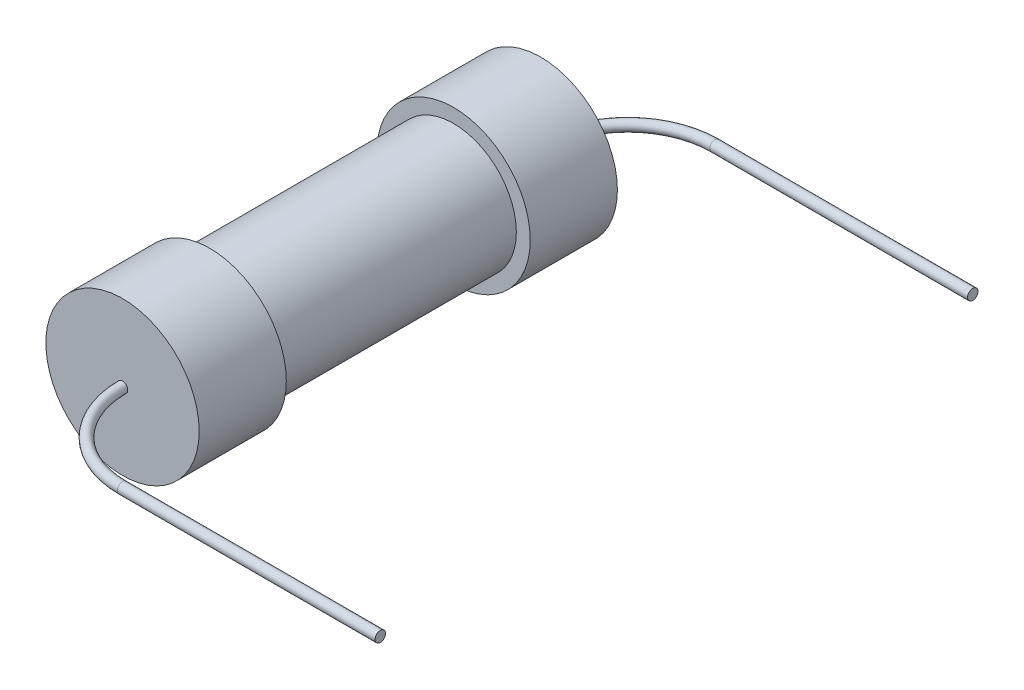
ISO-10303-21;
HEADER;
FILE_DESCRIPTION(('STEP AP214'),'2;1');
FILE_NAME('part.step','',(''),(''),'','','');
FILE_SCHEMA(('AUTOMOTIVE_DESIGN { 1 0 10303 214 1 1 1 1 }'));
ENDSEC;
DATA;
#1=APPLICATION_CONTEXT('core data for automotive mechanical design processes');
#2=APPLICATION_PROTOCOL_DEFINITION('international standard','automotive_design',2000,#1);
#3=PRODUCT_CONTEXT('',#1,'mechanical');
#4=PRODUCT('Part','Part','',(#3));
#5=PRODUCT_RELATED_PRODUCT_CATEGORY('part','',(#4));
#6=PRODUCT_DEFINITION_FORMATION('','',#4);
#7=PRODUCT_DEFINITION_CONTEXT('part definition',#1,'design');
#8=PRODUCT_DEFINITION('design','',#6,#7);
#9=PRODUCT_DEFINITION_SHAPE('','',#8);
#10=(LENGTH_UNIT() NAMED_UNIT(*) SI_UNIT(.MILLI.,.METRE.));
#11=(NAMED_UNIT(*) PLANE_ANGLE_UNIT() SI_UNIT($,.RADIAN.));
#12=(NAMED_UNIT(*) SI_UNIT($,.STERADIAN.) SOLID_ANGLE_UNIT());
#13=UNCERTAINTY_MEASURE_WITH_UNIT(LENGTH_MEASURE(1.E-05),#10,'distance_accuracy_value','');
#14=(GEOMETRIC_REPRESENTATION_CONTEXT(3) GLOBAL_UNCERTAINTY_ASSIGNED_CONTEXT((#13)) GLOBAL_UNIT_ASSIGNED_CONTEXT((#10,
#11,#12)) REPRESENTATION_CONTEXT('',''));
#15=CARTESIAN_POINT('',(0.,0.,0.));
#16=DIRECTION('',(0.,0.,1.));
#17=DIRECTION('',(1.,0.,0.));
#18=AXIS2_PLACEMENT_3D('',#15,#16,#17);
#19=CARTESIAN_POINT('',(0.,0.,3.));
#20=DIRECTION('',(0.,0.,1.));
#21=DIRECTION('',(1.,0.,0.));
#22=AXIS2_PLACEMENT_3D('',#19,#20,#21);
#23=CYLINDRICAL_SURFACE('',#22,0.9);
#24=CARTESIAN_POINT('',(0.,0.,-1.75));
#25=DIRECTION('',(0.,0.,1.));
#26=DIRECTION('',(1.,0.,0.));
#27=AXIS2_PLACEMENT_3D('',#24,#25,#26);
#28=CIRCLE('',#27,0.9);
#29=CARTESIAN_POINT('',(0.9,0.,-1.75));
#30=VERTEX_POINT('',#29);
#31=EDGE_CURVE('E67',#30,#30,#28,.T.);
#32=ORIENTED_EDGE('',*,*,#31,.T.);
#33=EDGE_LOOP('',(#32));
#34=FACE_BOUND('',#33,.T.);
#35=CARTESIAN_POINT('',(0.,0.,1.75));
#36=DIRECTION('',(0.,0.,1.));
#37=DIRECTION('',(1.,0.,0.));
#38=AXIS2_PLACEMENT_3D('',#35,#36,#37);
#39=CIRCLE('',#38,0.9);
#40=CARTESIAN_POINT('',(0.9,0.,1.75));
#41=VERTEX_POINT('',#40);
#42=EDGE_CURVE('E85',#41,#41,#39,.T.);
#43=ORIENTED_EDGE('',*,*,#42,.F.);
#44=EDGE_LOOP('',(#43));
#45=FACE_BOUND('',#44,.T.);
#46=ADVANCED_FACE('F57',(#34,#45),#23,.T.);
#47=CARTESIAN_POINT('',(1.1,0.,-1.75));
#48=DIRECTION('',(0.,0.,1.));
#49=DIRECTION('',(1.,0.,0.));
#50=AXIS2_PLACEMENT_3D('',#47,#48,#49);
#51=PLANE('',#50);
#52=CARTESIAN_POINT('',(0.,0.,-1.75));
#53=DIRECTION('',(0.,0.,1.));
#54=DIRECTION('',(1.,0.,0.));
#55=AXIS2_PLACEMENT_3D('',#52,#53,#54);
#56=CIRCLE('',#55,1.1);
#57=CARTESIAN_POINT('',(1.1,0.,-1.75));
#58=VERTEX_POINT('',#57);
#59=EDGE_CURVE('E71',#58,#58,#56,.T.);
#60=ORIENTED_EDGE('',*,*,#59,.T.);
#61=EDGE_LOOP('',(#60));
#62=FACE_BOUND('',#61,.T.);
#63=ORIENTED_EDGE('',*,*,#31,.F.);
#64=EDGE_LOOP('',(#63));
#65=FACE_BOUND('',#64,.T.);
#66=ADVANCED_FACE('F118',(#62,#65),#51,.T.);
#67=CARTESIAN_POINT('',(0.,0.,3.));
#68=DIRECTION('',(0.,0.,1.));
#69=DIRECTION('',(1.,0.,0.));
#70=AXIS2_PLACEMENT_3D('',#67,#68,#69);
#71=CYLINDRICAL_SURFACE('',#70,1.1);
#72=CARTESIAN_POINT('',(0.,0.,-3.));
#73=DIRECTION('',(0.,0.,1.));
#74=DIRECTION('',(1.,0.,0.));
#75=AXIS2_PLACEMENT_3D('',#72,#73,#74);
#76=CIRCLE('',#75,1.1);
#77=CARTESIAN_POINT('',(1.1,0.,-3.));
#78=VERTEX_POINT('',#77);
#79=EDGE_CURVE('E76',#78,#78,#76,.T.);
#80=ORIENTED_EDGE('',*,*,#79,.T.);
#81=EDGE_LOOP('',(#80));
#82=FACE_BOUND('',#81,.T.);
#83=ORIENTED_EDGE('',*,*,#59,.F.);
#84=EDGE_LOOP('',(#83));
#85=FACE_BOUND('',#84,.T.);
#86=ADVANCED_FACE('F123',(#82,#85),#71,.T.);
#87=CARTESIAN_POINT('',(0.,0.,-3.));
#88=DIRECTION('',(0.,0.,-1.));
#89=DIRECTION('',(-1.,0.,0.));
#90=AXIS2_PLACEMENT_3D('',#87,#88,#89);
#91=PLANE('',#90);
#92=CARTESIAN_POINT('',(0.,0.,-2.99999999999999));
#93=DIRECTION('',(0.,0.,-1.));
#94=DIRECTION('',(-1.,0.,0.));
#95=AXIS2_PLACEMENT_3D('',#92,#93,#94);
#96=CIRCLE('',#95,0.075);
#97=CARTESIAN_POINT('',(-0.0750000000000002,0.,-2.99999999999999));
#98=VERTEX_POINT('',#97);
#99=EDGE_CURVE('E63',#98,#98,#96,.T.);
#100=ORIENTED_EDGE('',*,*,#99,.F.);
#101=EDGE_LOOP('',(#100));
#102=FACE_BOUND('',#101,.T.);
#103=ORIENTED_EDGE('',*,*,#79,.F.);
#104=EDGE_LOOP('',(#103));
#105=FACE_BOUND('',#104,.T.);
#106=ADVANCED_FACE('F143',(#102,#105),#91,.T.);
#107=CARTESIAN_POINT('',(1.1,0.,3.));
#108=DIRECTION('',(0.,0.,1.));
#109=DIRECTION('',(1.,0.,0.));
#110=AXIS2_PLACEMENT_3D('',#107,#108,#109);
#111=PLANE('',#110);
#112=CARTESIAN_POINT('',(0.,0.,2.99999999999999));
#113=DIRECTION('',(0.,0.,1.));
#114=DIRECTION('',(1.,0.,0.));
#115=AXIS2_PLACEMENT_3D('',#112,#113,#114);
#116=CIRCLE('',#115,0.075);
#117=CARTESIAN_POINT('',(-0.0750000000000002,0.,2.99999999999999));
#118=VERTEX_POINT('',#117);
#119=EDGE_CURVE('E11',#118,#118,#116,.T.);
#120=ORIENTED_EDGE('',*,*,#119,.F.);
#121=EDGE_LOOP('',(#120));
#122=FACE_BOUND('',#121,.T.);
#123=CARTESIAN_POINT('',(0.,0.,3.));
#124=DIRECTION('',(0.,0.,1.));
#125=DIRECTION('',(1.,0.,0.));
#126=AXIS2_PLACEMENT_3D('',#123,#124,#125);
#127=CIRCLE('',#126,1.1);
#128=CARTESIAN_POINT('',(1.1,0.,3.));
#129=VERTEX_POINT('',#128);
#130=EDGE_CURVE('E79',#129,#129,#127,.T.);
#131=ORIENTED_EDGE('',*,*,#130,.T.);
#132=EDGE_LOOP('',(#131));
#133=FACE_BOUND('',#132,.T.);
#134=ADVANCED_FACE('F138',(#122,#133),#111,.T.);
#135=CARTESIAN_POINT('',(0.,0.,3.));
#136=DIRECTION('',(0.,0.,1.));
#137=DIRECTION('',(1.,0.,0.));
#138=AXIS2_PLACEMENT_3D('',#135,#136,#137);
#139=CYLINDRICAL_SURFACE('',#138,1.1);
#140=CARTESIAN_POINT('',(0.,0.,1.75));
#141=DIRECTION('',(0.,0.,1.));
#142=DIRECTION('',(1.,0.,0.));
#143=AXIS2_PLACEMENT_3D('',#140,#141,#142);
#144=CIRCLE('',#143,1.1);
#145=CARTESIAN_POINT('',(1.1,0.,1.75));
#146=VERTEX_POINT('',#145);
#147=EDGE_CURVE('E82',#146,#146,#144,.T.);
#148=ORIENTED_EDGE('',*,*,#147,.T.);
#149=EDGE_LOOP('',(#148));
#150=FACE_BOUND('',#149,.T.);
#151=ORIENTED_EDGE('',*,*,#130,.F.);
#152=EDGE_LOOP('',(#151));
#153=FACE_BOUND('',#152,.T.);
#154=ADVANCED_FACE('F132',(#150,#153),#139,.T.);
#155=CARTESIAN_POINT('',(0.9,0.,1.75));
#156=DIRECTION('',(0.,0.,-1.));
#157=DIRECTION('',(-1.,0.,0.));
#158=AXIS2_PLACEMENT_3D('',#155,#156,#157);
#159=PLANE('',#158);
#160=ORIENTED_EDGE('',*,*,#42,.T.);
#161=EDGE_LOOP('',(#160));
#162=FACE_BOUND('',#161,.T.);
#163=ORIENTED_EDGE('',*,*,#147,.F.);
#164=EDGE_LOOP('',(#163));
#165=FACE_BOUND('',#164,.T.);
#166=ADVANCED_FACE('F129',(#162,#165),#159,.T.);
#167=CARTESIAN_POINT('',(4.94887620372708,0.,-4.24999999999999));
#168=DIRECTION('',(1.,0.,0.));
#169=DIRECTION('',(0.,0.,-1.));
#170=AXIS2_PLACEMENT_3D('',#167,#168,#169);
#171=PLANE('',#170);
#172=CARTESIAN_POINT('',(4.94887620372708,0.,-4.24999999999999));
#173=DIRECTION('',(1.,0.,0.));
#174=DIRECTION('',(0.,0.,-1.));
#175=AXIS2_PLACEMENT_3D('',#172,#173,#174);
#176=CIRCLE('',#175,0.075);
#177=CARTESIAN_POINT('',(4.94887620372708,0.,-4.325));
#178=VERTEX_POINT('',#177);
#179=EDGE_CURVE('E88',#178,#178,#176,.T.);
#180=ORIENTED_EDGE('',*,*,#179,.T.);
#181=EDGE_LOOP('',(#180));
#182=FACE_BOUND('',#181,.T.);
#183=ADVANCED_FACE('F113',(#182),#171,.T.);
#184=CARTESIAN_POINT('',(1.25,0.,-2.99999999999999));
#185=DIRECTION('',(0.,-1.,0.));
#186=DIRECTION('',(0.,0.,-1.));
#187=AXIS2_PLACEMENT_3D('',#184,#185,#186);
#188=TOROIDAL_SURFACE('',#187,1.25,0.075);
#189=CARTESIAN_POINT('',(1.25,0.,-4.24999999999999));
#190=DIRECTION('',(1.,0.,0.));
#191=DIRECTION('',(0.,0.,-1.));
#192=AXIS2_PLACEMENT_3D('',#189,#190,#191);
#193=CIRCLE('',#192,0.075);
#194=CARTESIAN_POINT('',(1.25,0.,-4.325));
#195=VERTEX_POINT('',#194);
#196=EDGE_CURVE('E91',#195,#195,#193,.T.);
#197=CARTESIAN_POINT('',(1.25,0.,-2.99999999999999));
#198=DIRECTION('',(0.,-1.,0.));
#199=DIRECTION('',(0.,0.,-1.));
#200=AXIS2_PLACEMENT_3D('',#197,#198,#199);
#201=CIRCLE('',#200,1.325);
#202=EDGE_CURVE('',#98,#195,#201,.T.);
#203=ORIENTED_EDGE('',*,*,#99,.T.);
#204=ORIENTED_EDGE('',*,*,#196,.F.);
#205=ORIENTED_EDGE('',*,*,#202,.T.);
#206=ORIENTED_EDGE('',*,*,#202,.F.);
#207=EDGE_LOOP('',(#203,#205,#204,#206));
#208=FACE_BOUND('',#207,.T.);
#209=ADVANCED_FACE('F181',(#208),#188,.T.);
#210=CARTESIAN_POINT('',(1.25,0.,-4.24999999999999));
#211=DIRECTION('',(1.,0.,0.));
#212=DIRECTION('',(0.,0.,-1.));
#213=AXIS2_PLACEMENT_3D('',#210,#211,#212);
#214=CYLINDRICAL_SURFACE('',#213,0.075);
#215=ORIENTED_EDGE('',*,*,#179,.F.);
#216=EDGE_LOOP('',(#215));
#217=FACE_BOUND('',#216,.T.);
#218=ORIENTED_EDGE('',*,*,#196,.T.);
#219=EDGE_LOOP('',(#218));
#220=FACE_BOUND('',#219,.T.);
#221=ADVANCED_FACE('F114',(#217,#220),#214,.T.);
#222=CARTESIAN_POINT('',(4.94887620372708,0.,4.24999999999999));
#223=DIRECTION('',(1.,0.,0.));
#224=DIRECTION('',(0.,0.,1.));
#225=AXIS2_PLACEMENT_3D('',#222,#223,#224);
#226=PLANE('',#225);
#227=CARTESIAN_POINT('',(4.94887620372708,0.,4.24999999999999));
#228=DIRECTION('',(-1.,0.,0.));
#229=DIRECTION('',(0.,0.,1.));
#230=AXIS2_PLACEMENT_3D('',#227,#228,#229);
#231=CIRCLE('',#230,0.075);
#232=CARTESIAN_POINT('',(4.94887620372708,0.,4.325));
#233=VERTEX_POINT('',#232);
#234=EDGE_CURVE('E94',#233,#233,#231,.F.);
#235=ORIENTED_EDGE('',*,*,#234,.T.);
#236=EDGE_LOOP('',(#235));
#237=FACE_BOUND('',#236,.T.);
#238=ADVANCED_FACE('F105',(#237),#226,.T.);
#239=CARTESIAN_POINT('',(1.25,0.,2.99999999999999));
#240=DIRECTION('',(0.,1.,0.));
#241=DIRECTION('',(0.,0.,1.));
#242=AXIS2_PLACEMENT_3D('',#239,#240,#241);
#243=TOROIDAL_SURFACE('',#242,1.25,0.075);
#244=CARTESIAN_POINT('',(1.25,0.,4.24999999999999));
#245=DIRECTION('',(-1.,0.,0.));
#246=DIRECTION('',(0.,0.,1.));
#247=AXIS2_PLACEMENT_3D('',#244,#245,#246);
#248=CIRCLE('',#247,0.075);
#249=CARTESIAN_POINT('',(1.25,0.,4.325));
#250=VERTEX_POINT('',#249);
#251=EDGE_CURVE('E97',#250,#250,#248,.F.);
#252=CARTESIAN_POINT('',(1.25,0.,2.99999999999999));
#253=DIRECTION('',(0.,1.,0.));
#254=DIRECTION('',(0.,0.,1.));
#255=AXIS2_PLACEMENT_3D('',#252,#253,#254);
#256=CIRCLE('',#255,1.325);
#257=EDGE_CURVE('',#118,#250,#256,.T.);
#258=ORIENTED_EDGE('',*,*,#119,.T.);
#259=ORIENTED_EDGE('',*,*,#251,.F.);
#260=ORIENTED_EDGE('',*,*,#257,.T.);
#261=ORIENTED_EDGE('',*,*,#257,.F.);
#262=EDGE_LOOP('',(#258,#260,#259,#261));
#263=FACE_BOUND('',#262,.T.);
#264=ADVANCED_FACE('F103',(#263),#243,.T.);
#265=CARTESIAN_POINT('',(1.25,0.,4.24999999999999));
#266=DIRECTION('',(1.,0.,0.));
#267=DIRECTION('',(0.,0.,-1.));
#268=AXIS2_PLACEMENT_3D('',#265,#266,#267);
#269=CYLINDRICAL_SURFACE('',#268,0.075);
#270=ORIENTED_EDGE('',*,*,#234,.F.);
#271=EDGE_LOOP('',(#270));
#272=FACE_BOUND('',#271,.T.);
#273=ORIENTED_EDGE('',*,*,#251,.T.);
#274=EDGE_LOOP('',(#273));
#275=FACE_BOUND('',#274,.T.);
#276=ADVANCED_FACE('F101',(#272,#275),#269,.T.);
#277=CLOSED_SHELL('',(#46,#66,#86,#106,#134,#154,#166,#183,#209,#221,#238,#264,#276));
#278=MANIFOLD_SOLID_BREP('B2',#277);
#279=ADVANCED_BREP_SHAPE_REPRESENTATION('',(#18,#278),#14);
#280=SHAPE_DEFINITION_REPRESENTATION(#9,#279);
ENDSEC;
END-ISO-10303-21;
